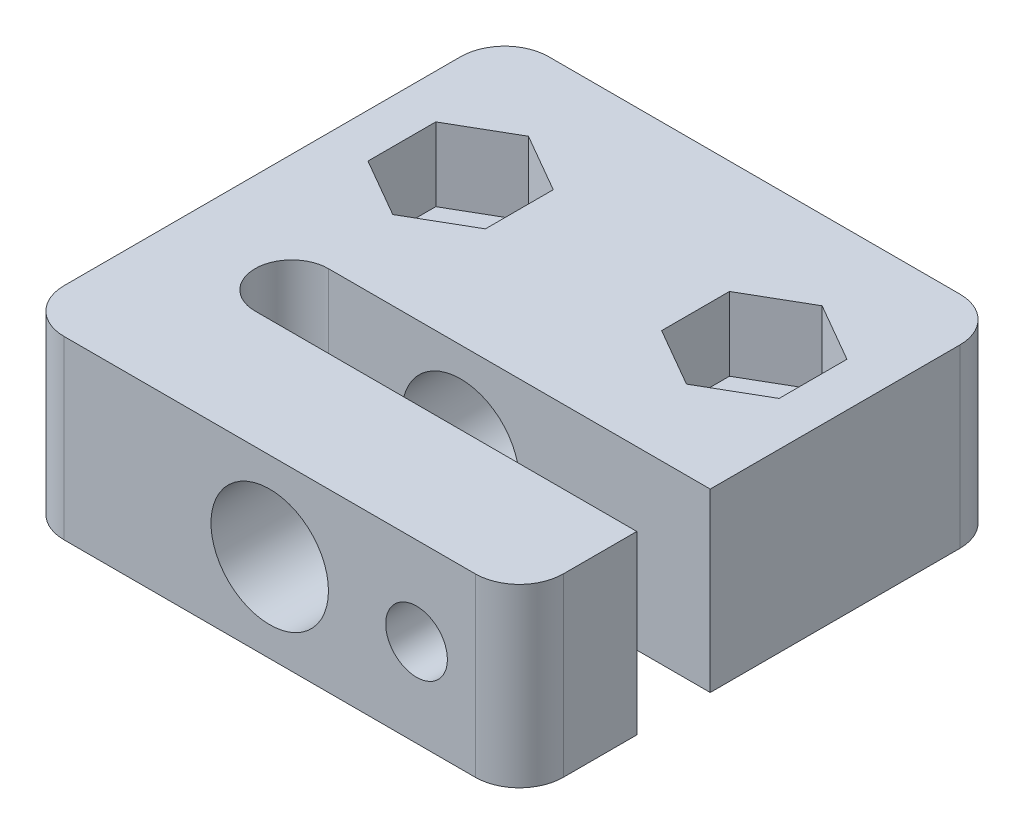
ISO-10303-21;
HEADER;
FILE_DESCRIPTION(('STEP AP214'),'2;1');
FILE_NAME('part.step','',(''),(''),'','','');
FILE_SCHEMA(('AUTOMOTIVE_DESIGN { 1 0 10303 214 1 1 1 1 }'));
ENDSEC;
DATA;
#1=APPLICATION_CONTEXT('core data for automotive mechanical design processes');
#2=APPLICATION_PROTOCOL_DEFINITION('international standard','automotive_design',2000,#1);
#3=PRODUCT_CONTEXT('',#1,'mechanical');
#4=PRODUCT('Part','Part','',(#3));
#5=PRODUCT_RELATED_PRODUCT_CATEGORY('part','',(#4));
#6=PRODUCT_DEFINITION_FORMATION('','',#4);
#7=PRODUCT_DEFINITION_CONTEXT('part definition',#1,'design');
#8=PRODUCT_DEFINITION('design','',#6,#7);
#9=PRODUCT_DEFINITION_SHAPE('','',#8);
#10=(LENGTH_UNIT() NAMED_UNIT(*) SI_UNIT(.MILLI.,.METRE.));
#11=(NAMED_UNIT(*) PLANE_ANGLE_UNIT() SI_UNIT($,.RADIAN.));
#12=(NAMED_UNIT(*) SI_UNIT($,.STERADIAN.) SOLID_ANGLE_UNIT());
#13=UNCERTAINTY_MEASURE_WITH_UNIT(LENGTH_MEASURE(1.E-05),#10,'distance_accuracy_value','');
#14=(GEOMETRIC_REPRESENTATION_CONTEXT(3) GLOBAL_UNCERTAINTY_ASSIGNED_CONTEXT((#13)) GLOBAL_UNIT_ASSIGNED_CONTEXT((#10,
#11,#12)) REPRESENTATION_CONTEXT('',''));
#15=CARTESIAN_POINT('',(0.,0.,0.));
#16=DIRECTION('',(0.,0.,1.));
#17=DIRECTION('',(1.,0.,0.));
#18=AXIS2_PLACEMENT_3D('',#15,#16,#17);
#19=CARTESIAN_POINT('',(17.,-6.,33.));
#20=DIRECTION('',(-1.,0.,0.));
#21=DIRECTION('',(0.,0.,1.));
#22=AXIS2_PLACEMENT_3D('',#19,#20,#21);
#23=PLANE('',#22);
#24=DIRECTION('',(0.,0.,-1.));
#25=VECTOR('',#24,1.);
#26=CARTESIAN_POINT('',(17.,6.,33.));
#27=LINE('',#26,#25);
#28=CARTESIAN_POINT('',(17.,6.,30.));
#29=VERTEX_POINT('',#28);
#30=CARTESIAN_POINT('',(17.,6.,25.));
#31=VERTEX_POINT('',#30);
#32=EDGE_CURVE('E227',#29,#31,#27,.T.);
#33=ORIENTED_EDGE('',*,*,#32,.F.);
#34=DIRECTION('',(0.,1.,0.));
#35=VECTOR('',#34,1.);
#36=CARTESIAN_POINT('',(17.,-6.,30.));
#37=LINE('',#36,#35);
#38=CARTESIAN_POINT('',(17.,-6.,30.));
#39=VERTEX_POINT('',#38);
#40=EDGE_CURVE('E11',#29,#39,#37,.F.);
#41=ORIENTED_EDGE('',*,*,#40,.T.);
#42=DIRECTION('',(0.,0.,-1.));
#43=VECTOR('',#42,1.);
#44=CARTESIAN_POINT('',(17.,-6.,33.));
#45=LINE('',#44,#43);
#46=CARTESIAN_POINT('',(17.,-6.,25.));
#47=VERTEX_POINT('',#46);
#48=EDGE_CURVE('E226',#39,#47,#45,.T.);
#49=ORIENTED_EDGE('',*,*,#48,.T.);
#50=DIRECTION('',(0.,1.,0.));
#51=VECTOR('',#50,1.);
#52=CARTESIAN_POINT('',(17.,-6.,25.));
#53=LINE('',#52,#51);
#54=EDGE_CURVE('E259',#47,#31,#53,.T.);
#55=ORIENTED_EDGE('',*,*,#54,.T.);
#56=EDGE_LOOP('',(#33,#41,#49,#55));
#57=FACE_BOUND('',#56,.T.);
#58=ADVANCED_FACE('F33',(#57),#23,.F.);
#59=CARTESIAN_POINT('',(0.,0.,0.));
#60=DIRECTION('',(0.,0.,1.));
#61=DIRECTION('',(1.,0.,0.));
#62=AXIS2_PLACEMENT_3D('',#59,#60,#61);
#63=CYLINDRICAL_SURFACE('',#62,4.);
#64=CARTESIAN_POINT('',(0.,0.,25.));
#65=DIRECTION('',(0.,0.,1.));
#66=DIRECTION('',(1.,0.,0.));
#67=AXIS2_PLACEMENT_3D('',#64,#65,#66);
#68=CIRCLE('',#67,4.);
#69=CARTESIAN_POINT('',(4.,0.,25.));
#70=VERTEX_POINT('',#69);
#71=EDGE_CURVE('E258',#70,#70,#68,.F.);
#72=ORIENTED_EDGE('',*,*,#71,.T.);
#73=EDGE_LOOP('',(#72));
#74=FACE_BOUND('',#73,.T.);
#75=CARTESIAN_POINT('',(0.,0.,33.));
#76=DIRECTION('',(0.,0.,1.));
#77=DIRECTION('',(1.,0.,0.));
#78=AXIS2_PLACEMENT_3D('',#75,#76,#77);
#79=CIRCLE('',#78,4.);
#80=CARTESIAN_POINT('',(4.,0.,33.));
#81=VERTEX_POINT('',#80);
#82=EDGE_CURVE('E238',#81,#81,#79,.T.);
#83=ORIENTED_EDGE('',*,*,#82,.T.);
#84=EDGE_LOOP('',(#83));
#85=FACE_BOUND('',#84,.T.);
#86=ADVANCED_FACE('F330',(#74,#85),#63,.F.);
#87=CARTESIAN_POINT('',(-10.,-6.00000000000001,10.));
#88=DIRECTION('',(0.,1.,0.));
#89=DIRECTION('',(-1.,0.,0.));
#90=AXIS2_PLACEMENT_3D('',#87,#88,#89);
#91=CYLINDRICAL_SURFACE('',#90,2.55);
#92=CARTESIAN_POINT('',(-10.,1.,10.));
#93=DIRECTION('',(0.,1.,0.));
#94=DIRECTION('',(0.,0.,1.));
#95=AXIS2_PLACEMENT_3D('',#92,#93,#94);
#96=CIRCLE('',#95,2.55);
#97=CARTESIAN_POINT('',(-10.,1.,12.55));
#98=VERTEX_POINT('',#97);
#99=EDGE_CURVE('E235',#98,#98,#96,.F.);
#100=ORIENTED_EDGE('',*,*,#99,.F.);
#101=EDGE_LOOP('',(#100));
#102=FACE_BOUND('',#101,.T.);
#103=CARTESIAN_POINT('',(-10.,-4.,10.));
#104=DIRECTION('',(0.,-1.,0.));
#105=DIRECTION('',(1.,0.,0.));
#106=AXIS2_PLACEMENT_3D('',#103,#104,#105);
#107=CIRCLE('',#106,2.55);
#108=CARTESIAN_POINT('',(-7.45,-4.,10.));
#109=VERTEX_POINT('',#108);
#110=EDGE_CURVE('E250',#109,#109,#107,.F.);
#111=ORIENTED_EDGE('',*,*,#110,.F.);
#112=EDGE_LOOP('',(#111));
#113=FACE_BOUND('',#112,.T.);
#114=ADVANCED_FACE('F336',(#102,#113),#91,.F.);
#115=CARTESIAN_POINT('',(10.,-6.00000000000001,10.));
#116=DIRECTION('',(0.,1.,0.));
#117=DIRECTION('',(-1.,0.,0.));
#118=AXIS2_PLACEMENT_3D('',#115,#116,#117);
#119=CYLINDRICAL_SURFACE('',#118,2.55);
#120=CARTESIAN_POINT('',(10.,1.,10.));
#121=DIRECTION('',(0.,-1.,0.));
#122=DIRECTION('',(1.,0.,0.));
#123=AXIS2_PLACEMENT_3D('',#120,#121,#122);
#124=CIRCLE('',#123,2.55);
#125=CARTESIAN_POINT('',(12.55,1.,10.));
#126=VERTEX_POINT('',#125);
#127=EDGE_CURVE('E240',#126,#126,#124,.F.);
#128=ORIENTED_EDGE('',*,*,#127,.T.);
#129=EDGE_LOOP('',(#128));
#130=FACE_BOUND('',#129,.T.);
#131=CARTESIAN_POINT('',(10.,-4.,10.));
#132=DIRECTION('',(0.,-1.,0.));
#133=DIRECTION('',(1.,0.,0.));
#134=AXIS2_PLACEMENT_3D('',#131,#132,#133);
#135=CIRCLE('',#134,2.55);
#136=CARTESIAN_POINT('',(12.55,-4.,10.));
#137=VERTEX_POINT('',#136);
#138=EDGE_CURVE('E245',#137,#137,#135,.F.);
#139=ORIENTED_EDGE('',*,*,#138,.F.);
#140=EDGE_LOOP('',(#139));
#141=FACE_BOUND('',#140,.T.);
#142=ADVANCED_FACE('F352',(#130,#141),#119,.F.);
#143=CARTESIAN_POINT('',(-17.,-6.,33.));
#144=DIRECTION('',(1.,0.,0.));
#145=DIRECTION('',(0.,0.,-1.));
#146=AXIS2_PLACEMENT_3D('',#143,#144,#145);
#147=PLANE('',#146);
#148=DIRECTION('',(0.,0.,-1.));
#149=VECTOR('',#148,1.);
#150=CARTESIAN_POINT('',(-17.,6.,33.));
#151=LINE('',#150,#149);
#152=CARTESIAN_POINT('',(-17.,6.,30.));
#153=VERTEX_POINT('',#152);
#154=CARTESIAN_POINT('',(-17.,6.,3.));
#155=VERTEX_POINT('',#154);
#156=EDGE_CURVE('E299',#153,#155,#151,.T.);
#157=ORIENTED_EDGE('',*,*,#156,.T.);
#158=DIRECTION('',(0.,-1.,0.));
#159=VECTOR('',#158,1.);
#160=CARTESIAN_POINT('',(-17.,-6.,3.));
#161=LINE('',#160,#159);
#162=CARTESIAN_POINT('',(-17.,-6.,3.));
#163=VERTEX_POINT('',#162);
#164=EDGE_CURVE('E264',#155,#163,#161,.T.);
#165=ORIENTED_EDGE('',*,*,#164,.T.);
#166=DIRECTION('',(0.,0.,-1.));
#167=VECTOR('',#166,1.);
#168=CARTESIAN_POINT('',(-17.,-6.,33.));
#169=LINE('',#168,#167);
#170=CARTESIAN_POINT('',(-17.,-6.,30.));
#171=VERTEX_POINT('',#170);
#172=EDGE_CURVE('E229',#171,#163,#169,.T.);
#173=ORIENTED_EDGE('',*,*,#172,.F.);
#174=DIRECTION('',(0.,-1.,0.));
#175=VECTOR('',#174,1.);
#176=CARTESIAN_POINT('',(-17.,6.,30.));
#177=LINE('',#176,#175);
#178=EDGE_CURVE('E234',#171,#153,#177,.F.);
#179=ORIENTED_EDGE('',*,*,#178,.T.);
#180=EDGE_LOOP('',(#157,#165,#173,#179));
#181=FACE_BOUND('',#180,.T.);
#182=ADVANCED_FACE('F319',(#181),#147,.F.);
#183=CARTESIAN_POINT('',(17.,-6.,33.));
#184=DIRECTION('',(0.,1.,0.));
#185=DIRECTION('',(-1.,0.,0.));
#186=AXIS2_PLACEMENT_3D('',#183,#184,#185);
#187=PLANE('',#186);
#188=CARTESIAN_POINT('',(-10.,-6.,10.));
#189=DIRECTION('',(0.,-1.,0.));
#190=DIRECTION('',(1.,0.,0.));
#191=AXIS2_PLACEMENT_3D('',#188,#189,#190);
#192=CIRCLE('',#191,4.5);
#193=CARTESIAN_POINT('',(-5.5,-6.,10.));
#194=VERTEX_POINT('',#193);
#195=EDGE_CURVE('E262',#194,#194,#192,.T.);
#196=ORIENTED_EDGE('',*,*,#195,.F.);
#197=EDGE_LOOP('',(#196));
#198=FACE_BOUND('',#197,.T.);
#199=CARTESIAN_POINT('',(10.,-6.,10.));
#200=DIRECTION('',(0.,-1.,0.));
#201=DIRECTION('',(1.,0.,0.));
#202=AXIS2_PLACEMENT_3D('',#199,#200,#201);
#203=CIRCLE('',#202,4.5);
#204=CARTESIAN_POINT('',(14.5,-6.,10.));
#205=VERTEX_POINT('',#204);
#206=EDGE_CURVE('E253',#205,#205,#203,.T.);
#207=ORIENTED_EDGE('',*,*,#206,.F.);
#208=EDGE_LOOP('',(#207));
#209=FACE_BOUND('',#208,.T.);
#210=ORIENTED_EDGE('',*,*,#172,.T.);
#211=CARTESIAN_POINT('',(-14.,-6.,3.));
#212=DIRECTION('',(0.,1.,0.));
#213=DIRECTION('',(-1.,0.,0.));
#214=AXIS2_PLACEMENT_3D('',#211,#212,#213);
#215=CIRCLE('',#214,3.);
#216=CARTESIAN_POINT('',(-14.,-6.,0.));
#217=VERTEX_POINT('',#216);
#218=EDGE_CURVE('E272',#163,#217,#215,.F.);
#219=ORIENTED_EDGE('',*,*,#218,.T.);
#220=DIRECTION('',(1.,0.,0.));
#221=VECTOR('',#220,1.);
#222=CARTESIAN_POINT('',(17.,-6.,0.));
#223=LINE('',#222,#221);
#224=CARTESIAN_POINT('',(14.,-6.,0.));
#225=VERTEX_POINT('',#224);
#226=EDGE_CURVE('E306',#217,#225,#223,.T.);
#227=ORIENTED_EDGE('',*,*,#226,.T.);
#228=CARTESIAN_POINT('',(14.,-6.,3.));
#229=DIRECTION('',(0.,1.,0.));
#230=DIRECTION('',(-1.,0.,0.));
#231=AXIS2_PLACEMENT_3D('',#228,#229,#230);
#232=CIRCLE('',#231,3.);
#233=CARTESIAN_POINT('',(17.,-6.,3.));
#234=VERTEX_POINT('',#233);
#235=EDGE_CURVE('E225',#225,#234,#232,.F.);
#236=ORIENTED_EDGE('',*,*,#235,.T.);
#237=CARTESIAN_POINT('',(17.,-6.,20.));
#238=VERTEX_POINT('',#237);
#239=EDGE_CURVE('E215',#238,#234,#45,.T.);
#240=ORIENTED_EDGE('',*,*,#239,.F.);
#241=DIRECTION('',(-1.,0.,0.));
#242=VECTOR('',#241,1.);
#243=CARTESIAN_POINT('',(17.,-6.,20.));
#244=LINE('',#243,#242);
#245=CARTESIAN_POINT('',(-9.,-6.00000000000001,20.));
#246=VERTEX_POINT('',#245);
#247=EDGE_CURVE('E195',#238,#246,#244,.T.);
#248=ORIENTED_EDGE('',*,*,#247,.T.);
#249=CARTESIAN_POINT('',(-9.,-6.00000000000001,22.5));
#250=DIRECTION('',(0.,1.,0.));
#251=DIRECTION('',(-1.,0.,0.));
#252=AXIS2_PLACEMENT_3D('',#249,#250,#251);
#253=CIRCLE('',#252,2.5);
#254=CARTESIAN_POINT('',(-9.,-6.00000000000001,25.));
#255=VERTEX_POINT('',#254);
#256=EDGE_CURVE('E207',#246,#255,#253,.T.);
#257=ORIENTED_EDGE('',*,*,#256,.T.);
#258=DIRECTION('',(1.,0.,0.));
#259=VECTOR('',#258,1.);
#260=CARTESIAN_POINT('',(17.,-6.,25.));
#261=LINE('',#260,#259);
#262=EDGE_CURVE('E219',#255,#47,#261,.T.);
#263=ORIENTED_EDGE('',*,*,#262,.T.);
#264=ORIENTED_EDGE('',*,*,#48,.F.);
#265=CARTESIAN_POINT('',(14.,-6.,30.));
#266=DIRECTION('',(0.,1.,0.));
#267=DIRECTION('',(-1.,0.,0.));
#268=AXIS2_PLACEMENT_3D('',#265,#266,#267);
#269=CIRCLE('',#268,3.);
#270=CARTESIAN_POINT('',(14.,-6.,33.));
#271=VERTEX_POINT('',#270);
#272=EDGE_CURVE('E269',#39,#271,#269,.F.);
#273=ORIENTED_EDGE('',*,*,#272,.T.);
#274=DIRECTION('',(1.,0.,0.));
#275=VECTOR('',#274,1.);
#276=CARTESIAN_POINT('',(17.,-6.,33.));
#277=LINE('',#276,#275);
#278=CARTESIAN_POINT('',(-14.,-6.,33.));
#279=VERTEX_POINT('',#278);
#280=EDGE_CURVE('E294',#279,#271,#277,.T.);
#281=ORIENTED_EDGE('',*,*,#280,.F.);
#282=CARTESIAN_POINT('',(-14.,-6.,30.));
#283=DIRECTION('',(0.,1.,0.));
#284=DIRECTION('',(-1.,0.,0.));
#285=AXIS2_PLACEMENT_3D('',#282,#283,#284);
#286=CIRCLE('',#285,3.);
#287=EDGE_CURVE('E267',#279,#171,#286,.F.);
#288=ORIENTED_EDGE('',*,*,#287,.T.);
#289=EDGE_LOOP('',(#210,#219,#227,#236,#240,#248,#257,#263,#264,#273,#281,#288));
#290=FACE_BOUND('',#289,.T.);
#291=ADVANCED_FACE('F222',(#198,#209,#290),#187,.F.);
#292=ORIENTED_EDGE('',*,*,#239,.T.);
#293=DIRECTION('',(0.,1.,0.));
#294=VECTOR('',#293,1.);
#295=CARTESIAN_POINT('',(17.,-6.,3.));
#296=LINE('',#295,#294);
#297=CARTESIAN_POINT('',(17.,6.,3.));
#298=VERTEX_POINT('',#297);
#299=EDGE_CURVE('E284',#234,#298,#296,.T.);
#300=ORIENTED_EDGE('',*,*,#299,.T.);
#301=CARTESIAN_POINT('',(17.,6.,20.));
#302=VERTEX_POINT('',#301);
#303=EDGE_CURVE('E218',#302,#298,#27,.T.);
#304=ORIENTED_EDGE('',*,*,#303,.F.);
#305=DIRECTION('',(0.,1.,0.));
#306=VECTOR('',#305,1.);
#307=CARTESIAN_POINT('',(17.,-6.,20.));
#308=LINE('',#307,#306);
#309=EDGE_CURVE('E200',#238,#302,#308,.T.);
#310=ORIENTED_EDGE('',*,*,#309,.F.);
#311=EDGE_LOOP('',(#292,#300,#304,#310));
#312=FACE_BOUND('',#311,.T.);
#313=ADVANCED_FACE('F213',(#312),#23,.F.);
#314=CARTESIAN_POINT('',(17.,6.,33.));
#315=DIRECTION('',(0.,-1.,0.));
#316=DIRECTION('',(1.,0.,0.));
#317=AXIS2_PLACEMENT_3D('',#314,#315,#316);
#318=PLANE('',#317);
#319=DIRECTION('',(0.866025403784438,0.,0.5));
#320=VECTOR('',#319,1.);
#321=CARTESIAN_POINT('',(10.,6.,14.618802153517));
#322=LINE('',#321,#320);
#323=CARTESIAN_POINT('',(6.00000000000001,6.,12.3094010767585));
#324=VERTEX_POINT('',#323);
#325=CARTESIAN_POINT('',(10.,6.,14.618802153517));
#326=VERTEX_POINT('',#325);
#327=EDGE_CURVE('E414',#324,#326,#322,.T.);
#328=ORIENTED_EDGE('',*,*,#327,.F.);
#329=DIRECTION('',(0.,0.,1.));
#330=VECTOR('',#329,1.);
#331=CARTESIAN_POINT('',(6.00000000000001,6.,12.3094010767585));
#332=LINE('',#331,#330);
#333=CARTESIAN_POINT('',(6.,6.,7.6905989232415));
#334=VERTEX_POINT('',#333);
#335=EDGE_CURVE('E248',#334,#324,#332,.T.);
#336=ORIENTED_EDGE('',*,*,#335,.F.);
#337=DIRECTION('',(-0.866025403784439,0.,0.5));
#338=VECTOR('',#337,1.);
#339=CARTESIAN_POINT('',(6.,6.,7.6905989232415));
#340=LINE('',#339,#338);
#341=CARTESIAN_POINT('',(10.,6.,5.381197846483));
#342=VERTEX_POINT('',#341);
#343=EDGE_CURVE('E397',#342,#334,#340,.T.);
#344=ORIENTED_EDGE('',*,*,#343,.F.);
#345=DIRECTION('',(-0.866025403784439,0.,-0.5));
#346=VECTOR('',#345,1.);
#347=CARTESIAN_POINT('',(10.,6.,5.381197846483));
#348=LINE('',#347,#346);
#349=CARTESIAN_POINT('',(14.,6.,7.6905989232415));
#350=VERTEX_POINT('',#349);
#351=EDGE_CURVE('E423',#350,#342,#348,.T.);
#352=ORIENTED_EDGE('',*,*,#351,.F.);
#353=DIRECTION('',(0.,0.,-1.));
#354=VECTOR('',#353,1.);
#355=CARTESIAN_POINT('',(14.,6.,7.6905989232415));
#356=LINE('',#355,#354);
#357=CARTESIAN_POINT('',(14.,6.,12.3094010767585));
#358=VERTEX_POINT('',#357);
#359=EDGE_CURVE('E420',#358,#350,#356,.T.);
#360=ORIENTED_EDGE('',*,*,#359,.F.);
#361=DIRECTION('',(0.866025403784439,0.,-0.5));
#362=VECTOR('',#361,1.);
#363=CARTESIAN_POINT('',(14.,6.,12.3094010767585));
#364=LINE('',#363,#362);
#365=EDGE_CURVE('E417',#326,#358,#364,.T.);
#366=ORIENTED_EDGE('',*,*,#365,.F.);
#367=EDGE_LOOP('',(#328,#336,#344,#352,#360,#366));
#368=FACE_BOUND('',#367,.T.);
#369=DIRECTION('',(-0.866025403784439,0.,0.5));
#370=VECTOR('',#369,1.);
#371=CARTESIAN_POINT('',(-10.,6.,5.381197846483));
#372=LINE('',#371,#370);
#373=CARTESIAN_POINT('',(-10.,6.,5.381197846483));
#374=VERTEX_POINT('',#373);
#375=CARTESIAN_POINT('',(-14.,6.,7.6905989232415));
#376=VERTEX_POINT('',#375);
#377=EDGE_CURVE('E460',#374,#376,#372,.T.);
#378=ORIENTED_EDGE('',*,*,#377,.F.);
#379=DIRECTION('',(-0.866025403784439,0.,-0.5));
#380=VECTOR('',#379,1.);
#381=CARTESIAN_POINT('',(-6.00000000000001,6.,7.6905989232415));
#382=LINE('',#381,#380);
#383=CARTESIAN_POINT('',(-6.00000000000001,6.,7.6905989232415));
#384=VERTEX_POINT('',#383);
#385=EDGE_CURVE('E243',#384,#374,#382,.T.);
#386=ORIENTED_EDGE('',*,*,#385,.F.);
#387=DIRECTION('',(0.,0.,-1.));
#388=VECTOR('',#387,1.);
#389=CARTESIAN_POINT('',(-6.00000000000001,6.,12.3094010767585));
#390=LINE('',#389,#388);
#391=CARTESIAN_POINT('',(-6.00000000000001,6.,12.3094010767585));
#392=VERTEX_POINT('',#391);
#393=EDGE_CURVE('E443',#392,#384,#390,.T.);
#394=ORIENTED_EDGE('',*,*,#393,.F.);
#395=DIRECTION('',(0.866025403784438,0.,-0.5));
#396=VECTOR('',#395,1.);
#397=CARTESIAN_POINT('',(-10.,6.,14.618802153517));
#398=LINE('',#397,#396);
#399=CARTESIAN_POINT('',(-10.,6.,14.618802153517));
#400=VERTEX_POINT('',#399);
#401=EDGE_CURVE('E469',#400,#392,#398,.T.);
#402=ORIENTED_EDGE('',*,*,#401,.F.);
#403=DIRECTION('',(0.866025403784439,0.,0.5));
#404=VECTOR('',#403,1.);
#405=CARTESIAN_POINT('',(-14.,6.,12.3094010767585));
#406=LINE('',#405,#404);
#407=CARTESIAN_POINT('',(-14.,6.,12.3094010767585));
#408=VERTEX_POINT('',#407);
#409=EDGE_CURVE('E466',#408,#400,#406,.T.);
#410=ORIENTED_EDGE('',*,*,#409,.F.);
#411=DIRECTION('',(0.,0.,1.));
#412=VECTOR('',#411,1.);
#413=CARTESIAN_POINT('',(-14.,6.,7.6905989232415));
#414=LINE('',#413,#412);
#415=EDGE_CURVE('E463',#376,#408,#414,.T.);
#416=ORIENTED_EDGE('',*,*,#415,.F.);
#417=EDGE_LOOP('',(#378,#386,#394,#402,#410,#416));
#418=FACE_BOUND('',#417,.T.);
#419=DIRECTION('',(-1.,0.,0.));
#420=VECTOR('',#419,1.);
#421=CARTESIAN_POINT('',(17.,6.,0.));
#422=LINE('',#421,#420);
#423=CARTESIAN_POINT('',(14.,6.,0.));
#424=VERTEX_POINT('',#423);
#425=CARTESIAN_POINT('',(-14.,6.,0.));
#426=VERTEX_POINT('',#425);
#427=EDGE_CURVE('E302',#424,#426,#422,.T.);
#428=ORIENTED_EDGE('',*,*,#427,.T.);
#429=CARTESIAN_POINT('',(-14.,6.,3.));
#430=DIRECTION('',(0.,-1.,0.));
#431=DIRECTION('',(1.,0.,0.));
#432=AXIS2_PLACEMENT_3D('',#429,#430,#431);
#433=CIRCLE('',#432,3.);
#434=EDGE_CURVE('E282',#426,#155,#433,.F.);
#435=ORIENTED_EDGE('',*,*,#434,.T.);
#436=ORIENTED_EDGE('',*,*,#156,.F.);
#437=CARTESIAN_POINT('',(-14.,6.,30.));
#438=DIRECTION('',(0.,-1.,0.));
#439=DIRECTION('',(1.,0.,0.));
#440=AXIS2_PLACEMENT_3D('',#437,#438,#439);
#441=CIRCLE('',#440,3.);
#442=CARTESIAN_POINT('',(-14.,6.,33.));
#443=VERTEX_POINT('',#442);
#444=EDGE_CURVE('E48',#153,#443,#441,.F.);
#445=ORIENTED_EDGE('',*,*,#444,.T.);
#446=DIRECTION('',(-1.,0.,0.));
#447=VECTOR('',#446,1.);
#448=CARTESIAN_POINT('',(17.,6.,33.));
#449=LINE('',#448,#447);
#450=CARTESIAN_POINT('',(14.,6.,33.));
#451=VERTEX_POINT('',#450);
#452=EDGE_CURVE('E291',#451,#443,#449,.T.);
#453=ORIENTED_EDGE('',*,*,#452,.F.);
#454=CARTESIAN_POINT('',(14.,6.,30.));
#455=DIRECTION('',(0.,-1.,0.));
#456=DIRECTION('',(1.,0.,0.));
#457=AXIS2_PLACEMENT_3D('',#454,#455,#456);
#458=CIRCLE('',#457,3.);
#459=EDGE_CURVE('E56',#451,#29,#458,.F.);
#460=ORIENTED_EDGE('',*,*,#459,.T.);
#461=ORIENTED_EDGE('',*,*,#32,.T.);
#462=DIRECTION('',(1.,0.,0.));
#463=VECTOR('',#462,1.);
#464=CARTESIAN_POINT('',(17.,6.,25.));
#465=LINE('',#464,#463);
#466=CARTESIAN_POINT('',(-9.,6.,25.));
#467=VERTEX_POINT('',#466);
#468=EDGE_CURVE('E208',#467,#31,#465,.T.);
#469=ORIENTED_EDGE('',*,*,#468,.F.);
#470=CARTESIAN_POINT('',(-9.,6.,22.5));
#471=DIRECTION('',(0.,1.,0.));
#472=DIRECTION('',(-1.,0.,0.));
#473=AXIS2_PLACEMENT_3D('',#470,#471,#472);
#474=CIRCLE('',#473,2.5);
#475=CARTESIAN_POINT('',(-9.,6.,20.));
#476=VERTEX_POINT('',#475);
#477=EDGE_CURVE('E368',#476,#467,#474,.T.);
#478=ORIENTED_EDGE('',*,*,#477,.F.);
#479=DIRECTION('',(-1.,0.,0.));
#480=VECTOR('',#479,1.);
#481=CARTESIAN_POINT('',(17.,6.,20.));
#482=LINE('',#481,#480);
#483=EDGE_CURVE('E365',#302,#476,#482,.T.);
#484=ORIENTED_EDGE('',*,*,#483,.F.);
#485=ORIENTED_EDGE('',*,*,#303,.T.);
#486=CARTESIAN_POINT('',(14.,6.,3.));
#487=DIRECTION('',(0.,-1.,0.));
#488=DIRECTION('',(1.,0.,0.));
#489=AXIS2_PLACEMENT_3D('',#486,#487,#488);
#490=CIRCLE('',#489,3.);
#491=EDGE_CURVE('E280',#298,#424,#490,.F.);
#492=ORIENTED_EDGE('',*,*,#491,.T.);
#493=EDGE_LOOP('',(#428,#435,#436,#445,#453,#460,#461,#469,#478,#484,#485,#492));
#494=FACE_BOUND('',#493,.T.);
#495=ADVANCED_FACE('F297',(#368,#418,#494),#318,.F.);
#496=CARTESIAN_POINT('',(0.,0.,33.));
#497=DIRECTION('',(0.,0.,1.));
#498=DIRECTION('',(1.,0.,0.));
#499=AXIS2_PLACEMENT_3D('',#496,#497,#498);
#500=PLANE('',#499);
#501=CARTESIAN_POINT('',(10.,0.,33.));
#502=DIRECTION('',(0.,0.,1.));
#503=DIRECTION('',(1.,0.,0.));
#504=AXIS2_PLACEMENT_3D('',#501,#502,#503);
#505=CIRCLE('',#504,2.09999999999999);
#506=CARTESIAN_POINT('',(12.1,0.,33.));
#507=VERTEX_POINT('',#506);
#508=EDGE_CURVE('E373',#507,#507,#505,.T.);
#509=ORIENTED_EDGE('',*,*,#508,.F.);
#510=EDGE_LOOP('',(#509));
#511=FACE_BOUND('',#510,.T.);
#512=ORIENTED_EDGE('',*,*,#82,.F.);
#513=EDGE_LOOP('',(#512));
#514=FACE_BOUND('',#513,.T.);
#515=ORIENTED_EDGE('',*,*,#280,.T.);
#516=DIRECTION('',(0.,1.,0.));
#517=VECTOR('',#516,1.);
#518=CARTESIAN_POINT('',(14.,6.,33.));
#519=LINE('',#518,#517);
#520=EDGE_CURVE('E41',#271,#451,#519,.T.);
#521=ORIENTED_EDGE('',*,*,#520,.T.);
#522=ORIENTED_EDGE('',*,*,#452,.T.);
#523=DIRECTION('',(0.,-1.,0.));
#524=VECTOR('',#523,1.);
#525=CARTESIAN_POINT('',(-14.,-6.,33.));
#526=LINE('',#525,#524);
#527=EDGE_CURVE('E286',#443,#279,#526,.T.);
#528=ORIENTED_EDGE('',*,*,#527,.T.);
#529=EDGE_LOOP('',(#515,#521,#522,#528));
#530=FACE_BOUND('',#529,.T.);
#531=ADVANCED_FACE('F290',(#511,#514,#530),#500,.T.);
#532=CARTESIAN_POINT('',(0.,0.,0.));
#533=DIRECTION('',(0.,0.,1.));
#534=DIRECTION('',(1.,0.,0.));
#535=AXIS2_PLACEMENT_3D('',#532,#533,#534);
#536=PLANE('',#535);
#537=CARTESIAN_POINT('',(0.,0.,0.));
#538=DIRECTION('',(0.,0.,1.));
#539=DIRECTION('',(1.,0.,0.));
#540=AXIS2_PLACEMENT_3D('',#537,#538,#539);
#541=CIRCLE('',#540,4.);
#542=CARTESIAN_POINT('',(4.,0.,0.));
#543=VERTEX_POINT('',#542);
#544=EDGE_CURVE('E308',#543,#543,#541,.T.);
#545=ORIENTED_EDGE('',*,*,#544,.T.);
#546=EDGE_LOOP('',(#545));
#547=FACE_BOUND('',#546,.T.);
#548=ORIENTED_EDGE('',*,*,#226,.F.);
#549=DIRECTION('',(0.,-1.,0.));
#550=VECTOR('',#549,1.);
#551=CARTESIAN_POINT('',(-14.,0.,0.));
#552=LINE('',#551,#550);
#553=EDGE_CURVE('E276',#217,#426,#552,.F.);
#554=ORIENTED_EDGE('',*,*,#553,.T.);
#555=ORIENTED_EDGE('',*,*,#427,.F.);
#556=DIRECTION('',(0.,1.,0.));
#557=VECTOR('',#556,1.);
#558=CARTESIAN_POINT('',(14.,0.,0.));
#559=LINE('',#558,#557);
#560=EDGE_CURVE('E274',#424,#225,#559,.F.);
#561=ORIENTED_EDGE('',*,*,#560,.T.);
#562=EDGE_LOOP('',(#548,#554,#555,#561));
#563=FACE_BOUND('',#562,.T.);
#564=ADVANCED_FACE('F491',(#547,#563),#536,.F.);
#565=CARTESIAN_POINT('',(0.,0.,20.));
#566=DIRECTION('',(0.,0.,-1.));
#567=DIRECTION('',(-1.,0.,0.));
#568=AXIS2_PLACEMENT_3D('',#565,#566,#567);
#569=CIRCLE('',#568,4.);
#570=CARTESIAN_POINT('',(-4.,0.,20.));
#571=VERTEX_POINT('',#570);
#572=EDGE_CURVE('E255',#571,#571,#569,.F.);
#573=ORIENTED_EDGE('',*,*,#572,.T.);
#574=EDGE_LOOP('',(#573));
#575=FACE_BOUND('',#574,.T.);
#576=ORIENTED_EDGE('',*,*,#544,.F.);
#577=EDGE_LOOP('',(#576));
#578=FACE_BOUND('',#577,.T.);
#579=ADVANCED_FACE('F339',(#575,#578),#63,.F.);
#580=CARTESIAN_POINT('',(0.,1.,0.));
#581=DIRECTION('',(0.,1.,0.));
#582=DIRECTION('',(0.,0.,1.));
#583=AXIS2_PLACEMENT_3D('',#580,#581,#582);
#584=PLANE('',#583);
#585=DIRECTION('',(-0.866025403784439,0.,-0.5));
#586=VECTOR('',#585,1.);
#587=CARTESIAN_POINT('',(-6.00000000000001,1.,7.6905989232415));
#588=LINE('',#587,#586);
#589=CARTESIAN_POINT('',(-6.00000000000001,1.,7.6905989232415));
#590=VERTEX_POINT('',#589);
#591=CARTESIAN_POINT('',(-10.,1.,5.381197846483));
#592=VERTEX_POINT('',#591);
#593=EDGE_CURVE('E439',#590,#592,#588,.T.);
#594=ORIENTED_EDGE('',*,*,#593,.T.);
#595=DIRECTION('',(-0.866025403784439,0.,0.5));
#596=VECTOR('',#595,1.);
#597=CARTESIAN_POINT('',(-10.,1.,5.381197846483));
#598=LINE('',#597,#596);
#599=CARTESIAN_POINT('',(-14.,1.,7.6905989232415));
#600=VERTEX_POINT('',#599);
#601=EDGE_CURVE('E442',#592,#600,#598,.T.);
#602=ORIENTED_EDGE('',*,*,#601,.T.);
#603=DIRECTION('',(0.,0.,1.));
#604=VECTOR('',#603,1.);
#605=CARTESIAN_POINT('',(-14.,1.,7.6905989232415));
#606=LINE('',#605,#604);
#607=CARTESIAN_POINT('',(-14.,1.,12.3094010767585));
#608=VERTEX_POINT('',#607);
#609=EDGE_CURVE('E446',#600,#608,#606,.T.);
#610=ORIENTED_EDGE('',*,*,#609,.T.);
#611=DIRECTION('',(0.866025403784439,0.,0.5));
#612=VECTOR('',#611,1.);
#613=CARTESIAN_POINT('',(-14.,1.,12.3094010767585));
#614=LINE('',#613,#612);
#615=CARTESIAN_POINT('',(-10.,1.,14.618802153517));
#616=VERTEX_POINT('',#615);
#617=EDGE_CURVE('E449',#608,#616,#614,.T.);
#618=ORIENTED_EDGE('',*,*,#617,.T.);
#619=DIRECTION('',(0.866025403784438,0.,-0.5));
#620=VECTOR('',#619,1.);
#621=CARTESIAN_POINT('',(-10.,1.,14.618802153517));
#622=LINE('',#621,#620);
#623=CARTESIAN_POINT('',(-6.00000000000001,1.,12.3094010767585));
#624=VERTEX_POINT('',#623);
#625=EDGE_CURVE('E452',#616,#624,#622,.T.);
#626=ORIENTED_EDGE('',*,*,#625,.T.);
#627=DIRECTION('',(0.,0.,-1.));
#628=VECTOR('',#627,1.);
#629=CARTESIAN_POINT('',(-6.00000000000001,1.,12.3094010767585));
#630=LINE('',#629,#628);
#631=EDGE_CURVE('E455',#624,#590,#630,.T.);
#632=ORIENTED_EDGE('',*,*,#631,.T.);
#633=EDGE_LOOP('',(#594,#602,#610,#618,#626,#632));
#634=FACE_BOUND('',#633,.T.);
#635=ORIENTED_EDGE('',*,*,#99,.T.);
#636=EDGE_LOOP('',(#635));
#637=FACE_BOUND('',#636,.T.);
#638=ADVANCED_FACE('F502',(#634,#637),#584,.T.);
#639=CARTESIAN_POINT('',(-6.00000000000001,1.,7.6905989232415));
#640=DIRECTION('',(0.5,0.,-0.866025403784439));
#641=DIRECTION('',(-0.866025403784439,0.,-0.5));
#642=AXIS2_PLACEMENT_3D('',#639,#640,#641);
#643=PLANE('',#642);
#644=ORIENTED_EDGE('',*,*,#385,.T.);
#645=DIRECTION('',(0.,1.,0.));
#646=VECTOR('',#645,1.);
#647=CARTESIAN_POINT('',(-10.,1.,5.381197846483));
#648=LINE('',#647,#646);
#649=EDGE_CURVE('E458',#592,#374,#648,.T.);
#650=ORIENTED_EDGE('',*,*,#649,.F.);
#651=ORIENTED_EDGE('',*,*,#593,.F.);
#652=DIRECTION('',(0.,1.,0.));
#653=VECTOR('',#652,1.);
#654=CARTESIAN_POINT('',(-6.00000000000001,1.,7.6905989232415));
#655=LINE('',#654,#653);
#656=EDGE_CURVE('E239',#590,#384,#655,.T.);
#657=ORIENTED_EDGE('',*,*,#656,.T.);
#658=EDGE_LOOP('',(#644,#650,#651,#657));
#659=FACE_BOUND('',#658,.T.);
#660=ADVANCED_FACE('F510',(#659),#643,.F.);
#661=CARTESIAN_POINT('',(-6.00000000000001,1.,12.3094010767585));
#662=DIRECTION('',(1.,0.,0.));
#663=DIRECTION('',(0.,0.,-1.));
#664=AXIS2_PLACEMENT_3D('',#661,#662,#663);
#665=PLANE('',#664);
#666=ORIENTED_EDGE('',*,*,#393,.T.);
#667=ORIENTED_EDGE('',*,*,#656,.F.);
#668=ORIENTED_EDGE('',*,*,#631,.F.);
#669=DIRECTION('',(0.,1.,0.));
#670=VECTOR('',#669,1.);
#671=CARTESIAN_POINT('',(-6.00000000000001,1.,12.3094010767585));
#672=LINE('',#671,#670);
#673=EDGE_CURVE('E475',#624,#392,#672,.T.);
#674=ORIENTED_EDGE('',*,*,#673,.T.);
#675=EDGE_LOOP('',(#666,#667,#668,#674));
#676=FACE_BOUND('',#675,.T.);
#677=ADVANCED_FACE('F513',(#676),#665,.F.);
#678=CARTESIAN_POINT('',(-10.,1.,14.618802153517));
#679=DIRECTION('',(0.5,0.,0.866025403784438));
#680=DIRECTION('',(0.866025403784438,0.,-0.5));
#681=AXIS2_PLACEMENT_3D('',#678,#679,#680);
#682=PLANE('',#681);
#683=ORIENTED_EDGE('',*,*,#401,.T.);
#684=ORIENTED_EDGE('',*,*,#673,.F.);
#685=ORIENTED_EDGE('',*,*,#625,.F.);
#686=DIRECTION('',(0.,1.,0.));
#687=VECTOR('',#686,1.);
#688=CARTESIAN_POINT('',(-10.,1.,14.618802153517));
#689=LINE('',#688,#687);
#690=EDGE_CURVE('E477',#616,#400,#689,.T.);
#691=ORIENTED_EDGE('',*,*,#690,.T.);
#692=EDGE_LOOP('',(#683,#684,#685,#691));
#693=FACE_BOUND('',#692,.T.);
#694=ADVANCED_FACE('F527',(#693),#682,.F.);
#695=CARTESIAN_POINT('',(-14.,1.,12.3094010767585));
#696=DIRECTION('',(-0.5,0.,0.866025403784438));
#697=DIRECTION('',(0.866025403784439,0.,0.5));
#698=AXIS2_PLACEMENT_3D('',#695,#696,#697);
#699=PLANE('',#698);
#700=ORIENTED_EDGE('',*,*,#409,.T.);
#701=ORIENTED_EDGE('',*,*,#690,.F.);
#702=ORIENTED_EDGE('',*,*,#617,.F.);
#703=DIRECTION('',(0.,1.,0.));
#704=VECTOR('',#703,1.);
#705=CARTESIAN_POINT('',(-14.,1.,12.3094010767585));
#706=LINE('',#705,#704);
#707=EDGE_CURVE('E479',#608,#408,#706,.T.);
#708=ORIENTED_EDGE('',*,*,#707,.T.);
#709=EDGE_LOOP('',(#700,#701,#702,#708));
#710=FACE_BOUND('',#709,.T.);
#711=ADVANCED_FACE('F523',(#710),#699,.F.);
#712=CARTESIAN_POINT('',(-14.,1.,7.6905989232415));
#713=DIRECTION('',(-1.,0.,0.));
#714=DIRECTION('',(0.,-1.,0.));
#715=AXIS2_PLACEMENT_3D('',#712,#713,#714);
#716=PLANE('',#715);
#717=ORIENTED_EDGE('',*,*,#415,.T.);
#718=ORIENTED_EDGE('',*,*,#707,.F.);
#719=ORIENTED_EDGE('',*,*,#609,.F.);
#720=DIRECTION('',(0.,1.,0.));
#721=VECTOR('',#720,1.);
#722=CARTESIAN_POINT('',(-14.,1.,7.6905989232415));
#723=LINE('',#722,#721);
#724=EDGE_CURVE('E481',#600,#376,#723,.T.);
#725=ORIENTED_EDGE('',*,*,#724,.T.);
#726=EDGE_LOOP('',(#717,#718,#719,#725));
#727=FACE_BOUND('',#726,.T.);
#728=ADVANCED_FACE('F519',(#727),#716,.F.);
#729=CARTESIAN_POINT('',(-10.,1.,5.381197846483));
#730=DIRECTION('',(-0.5,0.,-0.866025403784439));
#731=DIRECTION('',(-0.866025403784439,0.,0.5));
#732=AXIS2_PLACEMENT_3D('',#729,#730,#731);
#733=PLANE('',#732);
#734=ORIENTED_EDGE('',*,*,#377,.T.);
#735=ORIENTED_EDGE('',*,*,#724,.F.);
#736=ORIENTED_EDGE('',*,*,#601,.F.);
#737=ORIENTED_EDGE('',*,*,#649,.T.);
#738=EDGE_LOOP('',(#734,#735,#736,#737));
#739=FACE_BOUND('',#738,.T.);
#740=ADVANCED_FACE('F515',(#739),#733,.F.);
#741=CARTESIAN_POINT('',(0.,1.,0.));
#742=DIRECTION('',(0.,-1.,0.));
#743=DIRECTION('',(1.,0.,0.));
#744=AXIS2_PLACEMENT_3D('',#741,#742,#743);
#745=PLANE('',#744);
#746=DIRECTION('',(0.,0.,1.));
#747=VECTOR('',#746,1.);
#748=CARTESIAN_POINT('',(6.00000000000001,1.,12.3094010767585));
#749=LINE('',#748,#747);
#750=CARTESIAN_POINT('',(6.00000000000001,1.,7.6905989232415));
#751=VERTEX_POINT('',#750);
#752=CARTESIAN_POINT('',(6.00000000000001,1.,12.3094010767585));
#753=VERTEX_POINT('',#752);
#754=EDGE_CURVE('E393',#751,#753,#749,.T.);
#755=ORIENTED_EDGE('',*,*,#754,.T.);
#756=DIRECTION('',(0.866025403784438,0.,0.5));
#757=VECTOR('',#756,1.);
#758=CARTESIAN_POINT('',(10.,1.,14.618802153517));
#759=LINE('',#758,#757);
#760=CARTESIAN_POINT('',(10.,1.,14.618802153517));
#761=VERTEX_POINT('',#760);
#762=EDGE_CURVE('E396',#753,#761,#759,.T.);
#763=ORIENTED_EDGE('',*,*,#762,.T.);
#764=DIRECTION('',(0.866025403784439,0.,-0.5));
#765=VECTOR('',#764,1.);
#766=CARTESIAN_POINT('',(14.,1.,12.3094010767585));
#767=LINE('',#766,#765);
#768=CARTESIAN_POINT('',(14.,1.,12.3094010767585));
#769=VERTEX_POINT('',#768);
#770=EDGE_CURVE('E400',#761,#769,#767,.T.);
#771=ORIENTED_EDGE('',*,*,#770,.T.);
#772=DIRECTION('',(0.,0.,-1.));
#773=VECTOR('',#772,1.);
#774=CARTESIAN_POINT('',(14.,1.,7.6905989232415));
#775=LINE('',#774,#773);
#776=CARTESIAN_POINT('',(14.,1.,7.6905989232415));
#777=VERTEX_POINT('',#776);
#778=EDGE_CURVE('E403',#769,#777,#775,.T.);
#779=ORIENTED_EDGE('',*,*,#778,.T.);
#780=DIRECTION('',(-0.866025403784439,0.,-0.5));
#781=VECTOR('',#780,1.);
#782=CARTESIAN_POINT('',(10.,1.,5.381197846483));
#783=LINE('',#782,#781);
#784=CARTESIAN_POINT('',(10.,1.,5.381197846483));
#785=VERTEX_POINT('',#784);
#786=EDGE_CURVE('E406',#777,#785,#783,.T.);
#787=ORIENTED_EDGE('',*,*,#786,.T.);
#788=DIRECTION('',(-0.866025403784439,0.,0.5));
#789=VECTOR('',#788,1.);
#790=CARTESIAN_POINT('',(6.00000000000001,1.,7.6905989232415));
#791=LINE('',#790,#789);
#792=EDGE_CURVE('E409',#785,#751,#791,.T.);
#793=ORIENTED_EDGE('',*,*,#792,.T.);
#794=EDGE_LOOP('',(#755,#763,#771,#779,#787,#793));
#795=FACE_BOUND('',#794,.T.);
#796=ORIENTED_EDGE('',*,*,#127,.F.);
#797=EDGE_LOOP('',(#796));
#798=FACE_BOUND('',#797,.T.);
#799=ADVANCED_FACE('F518',(#795,#798),#745,.F.);
#800=CARTESIAN_POINT('',(6.00000000000001,1.,12.3094010767585));
#801=DIRECTION('',(-1.,0.,0.));
#802=DIRECTION('',(0.,0.,1.));
#803=AXIS2_PLACEMENT_3D('',#800,#801,#802);
#804=PLANE('',#803);
#805=ORIENTED_EDGE('',*,*,#335,.T.);
#806=DIRECTION('',(0.,1.,0.));
#807=VECTOR('',#806,1.);
#808=CARTESIAN_POINT('',(6.00000000000001,1.,12.3094010767585));
#809=LINE('',#808,#807);
#810=EDGE_CURVE('E412',#753,#324,#809,.T.);
#811=ORIENTED_EDGE('',*,*,#810,.F.);
#812=ORIENTED_EDGE('',*,*,#754,.F.);
#813=DIRECTION('',(0.,1.,0.));
#814=VECTOR('',#813,1.);
#815=CARTESIAN_POINT('',(6.00000000000001,1.,7.6905989232415));
#816=LINE('',#815,#814);
#817=EDGE_CURVE('E244',#751,#334,#816,.T.);
#818=ORIENTED_EDGE('',*,*,#817,.T.);
#819=EDGE_LOOP('',(#805,#811,#812,#818));
#820=FACE_BOUND('',#819,.T.);
#821=ADVANCED_FACE('F538',(#820),#804,.F.);
#822=CARTESIAN_POINT('',(6.00000000000001,1.,7.6905989232415));
#823=DIRECTION('',(-0.5,0.,-0.866025403784439));
#824=DIRECTION('',(-0.866025403784439,0.,0.5));
#825=AXIS2_PLACEMENT_3D('',#822,#823,#824);
#826=PLANE('',#825);
#827=ORIENTED_EDGE('',*,*,#343,.T.);
#828=ORIENTED_EDGE('',*,*,#817,.F.);
#829=ORIENTED_EDGE('',*,*,#792,.F.);
#830=DIRECTION('',(0.,1.,0.));
#831=VECTOR('',#830,1.);
#832=CARTESIAN_POINT('',(10.,1.,5.381197846483));
#833=LINE('',#832,#831);
#834=EDGE_CURVE('E429',#785,#342,#833,.T.);
#835=ORIENTED_EDGE('',*,*,#834,.T.);
#836=EDGE_LOOP('',(#827,#828,#829,#835));
#837=FACE_BOUND('',#836,.T.);
#838=ADVANCED_FACE('F541',(#837),#826,.F.);
#839=CARTESIAN_POINT('',(10.,1.,5.381197846483));
#840=DIRECTION('',(0.5,0.,-0.866025403784439));
#841=DIRECTION('',(-0.866025403784439,0.,-0.5));
#842=AXIS2_PLACEMENT_3D('',#839,#840,#841);
#843=PLANE('',#842);
#844=ORIENTED_EDGE('',*,*,#351,.T.);
#845=ORIENTED_EDGE('',*,*,#834,.F.);
#846=ORIENTED_EDGE('',*,*,#786,.F.);
#847=DIRECTION('',(0.,1.,0.));
#848=VECTOR('',#847,1.);
#849=CARTESIAN_POINT('',(14.,1.,7.6905989232415));
#850=LINE('',#849,#848);
#851=EDGE_CURVE('E431',#777,#350,#850,.T.);
#852=ORIENTED_EDGE('',*,*,#851,.T.);
#853=EDGE_LOOP('',(#844,#845,#846,#852));
#854=FACE_BOUND('',#853,.T.);
#855=ADVANCED_FACE('F555',(#854),#843,.F.);
#856=CARTESIAN_POINT('',(14.,1.,7.6905989232415));
#857=DIRECTION('',(1.,0.,0.));
#858=DIRECTION('',(0.,1.,0.));
#859=AXIS2_PLACEMENT_3D('',#856,#857,#858);
#860=PLANE('',#859);
#861=ORIENTED_EDGE('',*,*,#359,.T.);
#862=ORIENTED_EDGE('',*,*,#851,.F.);
#863=ORIENTED_EDGE('',*,*,#778,.F.);
#864=DIRECTION('',(0.,1.,0.));
#865=VECTOR('',#864,1.);
#866=CARTESIAN_POINT('',(14.,1.,12.3094010767585));
#867=LINE('',#866,#865);
#868=EDGE_CURVE('E433',#769,#358,#867,.T.);
#869=ORIENTED_EDGE('',*,*,#868,.T.);
#870=EDGE_LOOP('',(#861,#862,#863,#869));
#871=FACE_BOUND('',#870,.T.);
#872=ADVANCED_FACE('F551',(#871),#860,.F.);
#873=CARTESIAN_POINT('',(14.,1.,12.3094010767585));
#874=DIRECTION('',(0.5,0.,0.866025403784438));
#875=DIRECTION('',(0.866025403784439,0.,-0.5));
#876=AXIS2_PLACEMENT_3D('',#873,#874,#875);
#877=PLANE('',#876);
#878=ORIENTED_EDGE('',*,*,#365,.T.);
#879=ORIENTED_EDGE('',*,*,#868,.F.);
#880=ORIENTED_EDGE('',*,*,#770,.F.);
#881=DIRECTION('',(0.,1.,0.));
#882=VECTOR('',#881,1.);
#883=CARTESIAN_POINT('',(10.,1.,14.618802153517));
#884=LINE('',#883,#882);
#885=EDGE_CURVE('E435',#761,#326,#884,.T.);
#886=ORIENTED_EDGE('',*,*,#885,.T.);
#887=EDGE_LOOP('',(#878,#879,#880,#886));
#888=FACE_BOUND('',#887,.T.);
#889=ADVANCED_FACE('F547',(#888),#877,.F.);
#890=CARTESIAN_POINT('',(10.,1.,14.618802153517));
#891=DIRECTION('',(-0.5,0.,0.866025403784438));
#892=DIRECTION('',(0.866025403784438,0.,0.5));
#893=AXIS2_PLACEMENT_3D('',#890,#891,#892);
#894=PLANE('',#893);
#895=ORIENTED_EDGE('',*,*,#327,.T.);
#896=ORIENTED_EDGE('',*,*,#885,.F.);
#897=ORIENTED_EDGE('',*,*,#762,.F.);
#898=ORIENTED_EDGE('',*,*,#810,.T.);
#899=EDGE_LOOP('',(#895,#896,#897,#898));
#900=FACE_BOUND('',#899,.T.);
#901=ADVANCED_FACE('F543',(#900),#894,.F.);
#902=CARTESIAN_POINT('',(10.,-4.,10.));
#903=DIRECTION('',(0.,-1.,0.));
#904=DIRECTION('',(1.,0.,0.));
#905=AXIS2_PLACEMENT_3D('',#902,#903,#904);
#906=PLANE('',#905);
#907=CARTESIAN_POINT('',(10.,-4.,10.));
#908=DIRECTION('',(0.,-1.,0.));
#909=DIRECTION('',(1.,0.,0.));
#910=AXIS2_PLACEMENT_3D('',#907,#908,#909);
#911=CIRCLE('',#910,4.5);
#912=CARTESIAN_POINT('',(14.5,-4.,10.));
#913=VERTEX_POINT('',#912);
#914=EDGE_CURVE('E249',#913,#913,#911,.T.);
#915=ORIENTED_EDGE('',*,*,#914,.T.);
#916=EDGE_LOOP('',(#915));
#917=FACE_BOUND('',#916,.T.);
#918=ORIENTED_EDGE('',*,*,#138,.T.);
#919=EDGE_LOOP('',(#918));
#920=FACE_BOUND('',#919,.T.);
#921=ADVANCED_FACE('F546',(#917,#920),#906,.T.);
#922=CARTESIAN_POINT('',(10.,-4.,10.));
#923=DIRECTION('',(0.,-1.,0.));
#924=DIRECTION('',(1.,0.,0.));
#925=AXIS2_PLACEMENT_3D('',#922,#923,#924);
#926=CYLINDRICAL_SURFACE('',#925,4.5);
#927=ORIENTED_EDGE('',*,*,#914,.F.);
#928=EDGE_LOOP('',(#927));
#929=FACE_BOUND('',#928,.T.);
#930=ORIENTED_EDGE('',*,*,#206,.T.);
#931=EDGE_LOOP('',(#930));
#932=FACE_BOUND('',#931,.T.);
#933=ADVANCED_FACE('F566',(#929,#932),#926,.F.);
#934=CARTESIAN_POINT('',(-10.,-4.,10.));
#935=DIRECTION('',(0.,-1.,0.));
#936=DIRECTION('',(1.,0.,0.));
#937=AXIS2_PLACEMENT_3D('',#934,#935,#936);
#938=PLANE('',#937);
#939=CARTESIAN_POINT('',(-10.,-4.,10.));
#940=DIRECTION('',(0.,-1.,0.));
#941=DIRECTION('',(1.,0.,0.));
#942=AXIS2_PLACEMENT_3D('',#939,#940,#941);
#943=CIRCLE('',#942,4.5);
#944=CARTESIAN_POINT('',(-5.5,-4.,10.));
#945=VERTEX_POINT('',#944);
#946=EDGE_CURVE('E254',#945,#945,#943,.T.);
#947=ORIENTED_EDGE('',*,*,#946,.T.);
#948=EDGE_LOOP('',(#947));
#949=FACE_BOUND('',#948,.T.);
#950=ORIENTED_EDGE('',*,*,#110,.T.);
#951=EDGE_LOOP('',(#950));
#952=FACE_BOUND('',#951,.T.);
#953=ADVANCED_FACE('F569',(#949,#952),#938,.T.);
#954=CARTESIAN_POINT('',(-10.,-4.,10.));
#955=DIRECTION('',(0.,-1.,0.));
#956=DIRECTION('',(1.,0.,0.));
#957=AXIS2_PLACEMENT_3D('',#954,#955,#956);
#958=CYLINDRICAL_SURFACE('',#957,4.5);
#959=ORIENTED_EDGE('',*,*,#946,.F.);
#960=EDGE_LOOP('',(#959));
#961=FACE_BOUND('',#960,.T.);
#962=ORIENTED_EDGE('',*,*,#195,.T.);
#963=EDGE_LOOP('',(#962));
#964=FACE_BOUND('',#963,.T.);
#965=ADVANCED_FACE('F574',(#961,#964),#958,.F.);
#966=CARTESIAN_POINT('',(17.,-6.,25.));
#967=DIRECTION('',(0.,0.,1.));
#968=DIRECTION('',(1.,0.,0.));
#969=AXIS2_PLACEMENT_3D('',#966,#967,#968);
#970=PLANE('',#969);
#971=CARTESIAN_POINT('',(10.,0.,25.));
#972=DIRECTION('',(0.,0.,1.));
#973=DIRECTION('',(1.,0.,0.));
#974=AXIS2_PLACEMENT_3D('',#971,#972,#973);
#975=CIRCLE('',#974,2.09999999999999);
#976=CARTESIAN_POINT('',(12.1,0.,25.));
#977=VERTEX_POINT('',#976);
#978=EDGE_CURVE('E369',#977,#977,#975,.T.);
#979=ORIENTED_EDGE('',*,*,#978,.T.);
#980=EDGE_LOOP('',(#979));
#981=FACE_BOUND('',#980,.T.);
#982=ORIENTED_EDGE('',*,*,#468,.T.);
#983=ORIENTED_EDGE('',*,*,#54,.F.);
#984=ORIENTED_EDGE('',*,*,#262,.F.);
#985=DIRECTION('',(0.,1.,0.));
#986=VECTOR('',#985,1.);
#987=CARTESIAN_POINT('',(-9.,-6.00000000000001,25.));
#988=LINE('',#987,#986);
#989=EDGE_CURVE('E382',#255,#467,#988,.T.);
#990=ORIENTED_EDGE('',*,*,#989,.T.);
#991=EDGE_LOOP('',(#982,#983,#984,#990));
#992=FACE_BOUND('',#991,.T.);
#993=ORIENTED_EDGE('',*,*,#71,.F.);
#994=EDGE_LOOP('',(#993));
#995=FACE_BOUND('',#994,.T.);
#996=ADVANCED_FACE('F577',(#981,#992,#995),#970,.F.);
#997=CARTESIAN_POINT('',(17.,-6.,20.));
#998=DIRECTION('',(0.,0.,-1.));
#999=DIRECTION('',(-1.,0.,0.));
#1000=AXIS2_PLACEMENT_3D('',#997,#998,#999);
#1001=PLANE('',#1000);
#1002=ORIENTED_EDGE('',*,*,#483,.T.);
#1003=DIRECTION('',(0.,1.,0.));
#1004=VECTOR('',#1003,1.);
#1005=CARTESIAN_POINT('',(-9.,-6.00000000000001,20.));
#1006=LINE('',#1005,#1004);
#1007=EDGE_CURVE('E202',#246,#476,#1006,.T.);
#1008=ORIENTED_EDGE('',*,*,#1007,.F.);
#1009=ORIENTED_EDGE('',*,*,#247,.F.);
#1010=ORIENTED_EDGE('',*,*,#309,.T.);
#1011=EDGE_LOOP('',(#1002,#1008,#1009,#1010));
#1012=FACE_BOUND('',#1011,.T.);
#1013=ORIENTED_EDGE('',*,*,#572,.F.);
#1014=EDGE_LOOP('',(#1013));
#1015=FACE_BOUND('',#1014,.T.);
#1016=ADVANCED_FACE('F198',(#1012,#1015),#1001,.F.);
#1017=CARTESIAN_POINT('',(-9.,-6.00000000000001,22.5));
#1018=DIRECTION('',(0.,1.,0.));
#1019=DIRECTION('',(-1.,0.,0.));
#1020=AXIS2_PLACEMENT_3D('',#1017,#1018,#1019);
#1021=CYLINDRICAL_SURFACE('',#1020,2.5);
#1022=ORIENTED_EDGE('',*,*,#477,.T.);
#1023=ORIENTED_EDGE('',*,*,#989,.F.);
#1024=ORIENTED_EDGE('',*,*,#256,.F.);
#1025=ORIENTED_EDGE('',*,*,#1007,.T.);
#1026=EDGE_LOOP('',(#1022,#1023,#1024,#1025));
#1027=FACE_BOUND('',#1026,.T.);
#1028=ADVANCED_FACE('F584',(#1027),#1021,.F.);
#1029=CARTESIAN_POINT('',(10.,0.,33.));
#1030=DIRECTION('',(0.,0.,1.));
#1031=DIRECTION('',(1.,0.,0.));
#1032=AXIS2_PLACEMENT_3D('',#1029,#1030,#1031);
#1033=CYLINDRICAL_SURFACE('',#1032,2.09999999999999);
#1034=ORIENTED_EDGE('',*,*,#978,.F.);
#1035=EDGE_LOOP('',(#1034));
#1036=FACE_BOUND('',#1035,.T.);
#1037=ORIENTED_EDGE('',*,*,#508,.T.);
#1038=EDGE_LOOP('',(#1037));
#1039=FACE_BOUND('',#1038,.T.);
#1040=ADVANCED_FACE('F359',(#1036,#1039),#1033,.F.);
#1041=CARTESIAN_POINT('',(-14.,-6.,3.));
#1042=DIRECTION('',(0.,-1.,0.));
#1043=DIRECTION('',(0.,0.,-1.));
#1044=AXIS2_PLACEMENT_3D('',#1041,#1042,#1043);
#1045=CYLINDRICAL_SURFACE('',#1044,3.);
#1046=ORIENTED_EDGE('',*,*,#434,.F.);
#1047=ORIENTED_EDGE('',*,*,#553,.F.);
#1048=ORIENTED_EDGE('',*,*,#218,.F.);
#1049=ORIENTED_EDGE('',*,*,#164,.F.);
#1050=EDGE_LOOP('',(#1046,#1047,#1048,#1049));
#1051=FACE_BOUND('',#1050,.T.);
#1052=ADVANCED_FACE('F316',(#1051),#1045,.T.);
#1053=CARTESIAN_POINT('',(14.,-6.,3.));
#1054=DIRECTION('',(0.,1.,0.));
#1055=DIRECTION('',(0.,0.,1.));
#1056=AXIS2_PLACEMENT_3D('',#1053,#1054,#1055);
#1057=CYLINDRICAL_SURFACE('',#1056,3.);
#1058=ORIENTED_EDGE('',*,*,#235,.F.);
#1059=ORIENTED_EDGE('',*,*,#560,.F.);
#1060=ORIENTED_EDGE('',*,*,#491,.F.);
#1061=ORIENTED_EDGE('',*,*,#299,.F.);
#1062=EDGE_LOOP('',(#1058,#1059,#1060,#1061));
#1063=FACE_BOUND('',#1062,.T.);
#1064=ADVANCED_FACE('F328',(#1063),#1057,.T.);
#1065=CARTESIAN_POINT('',(14.,0.,30.));
#1066=DIRECTION('',(0.,-1.,0.));
#1067=DIRECTION('',(0.,0.,-1.));
#1068=AXIS2_PLACEMENT_3D('',#1065,#1066,#1067);
#1069=CYLINDRICAL_SURFACE('',#1068,3.);
#1070=ORIENTED_EDGE('',*,*,#272,.F.);
#1071=ORIENTED_EDGE('',*,*,#40,.F.);
#1072=ORIENTED_EDGE('',*,*,#459,.F.);
#1073=ORIENTED_EDGE('',*,*,#520,.F.);
#1074=EDGE_LOOP('',(#1070,#1071,#1072,#1073));
#1075=FACE_BOUND('',#1074,.T.);
#1076=ADVANCED_FACE('F324',(#1075),#1069,.T.);
#1077=CARTESIAN_POINT('',(-14.,0.,30.));
#1078=DIRECTION('',(0.,1.,0.));
#1079=DIRECTION('',(0.,0.,1.));
#1080=AXIS2_PLACEMENT_3D('',#1077,#1078,#1079);
#1081=CYLINDRICAL_SURFACE('',#1080,3.);
#1082=ORIENTED_EDGE('',*,*,#444,.F.);
#1083=ORIENTED_EDGE('',*,*,#178,.F.);
#1084=ORIENTED_EDGE('',*,*,#287,.F.);
#1085=ORIENTED_EDGE('',*,*,#527,.F.);
#1086=EDGE_LOOP('',(#1082,#1083,#1084,#1085));
#1087=FACE_BOUND('',#1086,.T.);
#1088=ADVANCED_FACE('F35',(#1087),#1081,.T.);
#1089=CLOSED_SHELL('',(#58,#86,#114,#142,#182,#291,#313,#495,#531,#564,#579,#638,#660,#677,#694,
#711,#728,#740,#799,#821,#838,#855,#872,#889,#901,#921,#933,#953,#965,#996,#1016,#1028,#1040,
#1052,#1064,#1076,#1088));
#1090=MANIFOLD_SOLID_BREP('B2',#1089);
#1091=ADVANCED_BREP_SHAPE_REPRESENTATION('',(#18,#1090),#14);
#1092=SHAPE_DEFINITION_REPRESENTATION(#9,#1091);
ENDSEC;
END-ISO-10303-21;
